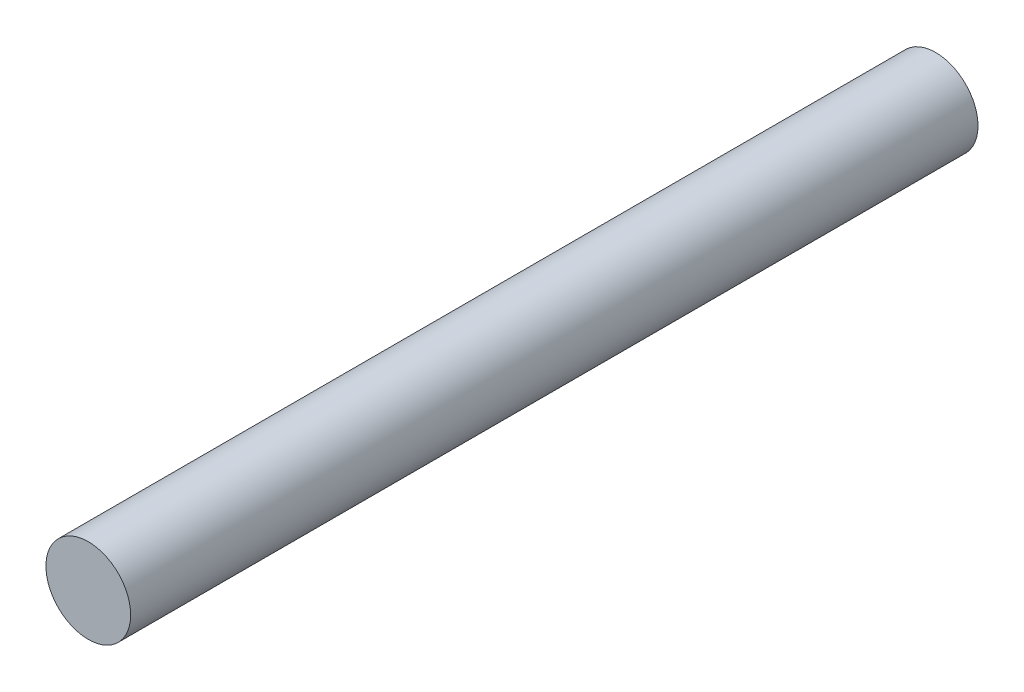
ISO-10303-21;
HEADER;
FILE_DESCRIPTION(('STEP AP214'),'2;1');
FILE_NAME('part.step','',(''),(''),'','','');
FILE_SCHEMA(('AUTOMOTIVE_DESIGN { 1 0 10303 214 1 1 1 1 }'));
ENDSEC;
DATA;
#1=APPLICATION_CONTEXT('core data for automotive mechanical design processes');
#2=APPLICATION_PROTOCOL_DEFINITION('international standard','automotive_design',2000,#1);
#3=PRODUCT_CONTEXT('',#1,'mechanical');
#4=PRODUCT('Part','Part','',(#3));
#5=PRODUCT_RELATED_PRODUCT_CATEGORY('part','',(#4));
#6=PRODUCT_DEFINITION_FORMATION('','',#4);
#7=PRODUCT_DEFINITION_CONTEXT('part definition',#1,'design');
#8=PRODUCT_DEFINITION('design','',#6,#7);
#9=PRODUCT_DEFINITION_SHAPE('','',#8);
#10=(LENGTH_UNIT() NAMED_UNIT(*) SI_UNIT(.MILLI.,.METRE.));
#11=(NAMED_UNIT(*) PLANE_ANGLE_UNIT() SI_UNIT($,.RADIAN.));
#12=(NAMED_UNIT(*) SI_UNIT($,.STERADIAN.) SOLID_ANGLE_UNIT());
#13=UNCERTAINTY_MEASURE_WITH_UNIT(LENGTH_MEASURE(1.E-05),#10,'distance_accuracy_value','');
#14=(GEOMETRIC_REPRESENTATION_CONTEXT(3) GLOBAL_UNCERTAINTY_ASSIGNED_CONTEXT((#13)) GLOBAL_UNIT_ASSIGNED_CONTEXT((#10,
#11,#12)) REPRESENTATION_CONTEXT('',''));
#15=CARTESIAN_POINT('',(0.,0.,0.));
#16=DIRECTION('',(0.,0.,1.));
#17=DIRECTION('',(1.,0.,0.));
#18=AXIS2_PLACEMENT_3D('',#15,#16,#17);
#19=CARTESIAN_POINT('',(0.,0.,120.));
#20=DIRECTION('',(0.,0.,-1.));
#21=DIRECTION('',(-1.,0.,0.));
#22=AXIS2_PLACEMENT_3D('',#19,#20,#21);
#23=CYLINDRICAL_SURFACE('',#22,6.);
#24=CARTESIAN_POINT('',(0.,0.,120.));
#25=DIRECTION('',(0.,0.,1.));
#26=DIRECTION('',(1.,0.,0.));
#27=AXIS2_PLACEMENT_3D('',#24,#25,#26);
#28=CIRCLE('',#27,6.);
#29=CARTESIAN_POINT('',(6.,0.,120.));
#30=VERTEX_POINT('',#29);
#31=EDGE_CURVE('E12',#30,#30,#28,.T.);
#32=ORIENTED_EDGE('',*,*,#31,.F.);
#33=EDGE_LOOP('',(#32));
#34=FACE_BOUND('',#33,.T.);
#35=CARTESIAN_POINT('',(0.,0.,0.));
#36=DIRECTION('',(0.,0.,1.));
#37=DIRECTION('',(1.,0.,0.));
#38=AXIS2_PLACEMENT_3D('',#35,#36,#37);
#39=CIRCLE('',#38,6.);
#40=CARTESIAN_POINT('',(6.,0.,0.));
#41=VERTEX_POINT('',#40);
#42=EDGE_CURVE('E47',#41,#41,#39,.T.);
#43=ORIENTED_EDGE('',*,*,#42,.T.);
#44=EDGE_LOOP('',(#43));
#45=FACE_BOUND('',#44,.T.);
#46=ADVANCED_FACE('F44',(#34,#45),#23,.T.);
#47=CARTESIAN_POINT('',(0.,0.,120.));
#48=DIRECTION('',(0.,0.,1.));
#49=DIRECTION('',(1.,0.,0.));
#50=AXIS2_PLACEMENT_3D('',#47,#48,#49);
#51=PLANE('',#50);
#52=ORIENTED_EDGE('',*,*,#31,.T.);
#53=EDGE_LOOP('',(#52));
#54=FACE_BOUND('',#53,.T.);
#55=ADVANCED_FACE('F59',(#54),#51,.T.);
#56=CARTESIAN_POINT('',(0.,0.,0.));
#57=DIRECTION('',(0.,0.,1.));
#58=DIRECTION('',(1.,0.,0.));
#59=AXIS2_PLACEMENT_3D('',#56,#57,#58);
#60=PLANE('',#59);
#61=ORIENTED_EDGE('',*,*,#42,.F.);
#62=EDGE_LOOP('',(#61));
#63=FACE_BOUND('',#62,.T.);
#64=ADVANCED_FACE('F57',(#63),#60,.F.);
#65=CLOSED_SHELL('',(#46,#55,#64));
#66=MANIFOLD_SOLID_BREP('B2',#65);
#67=ADVANCED_BREP_SHAPE_REPRESENTATION('',(#18,#66),#14);
#68=SHAPE_DEFINITION_REPRESENTATION(#9,#67);
ENDSEC;
END-ISO-10303-21;
